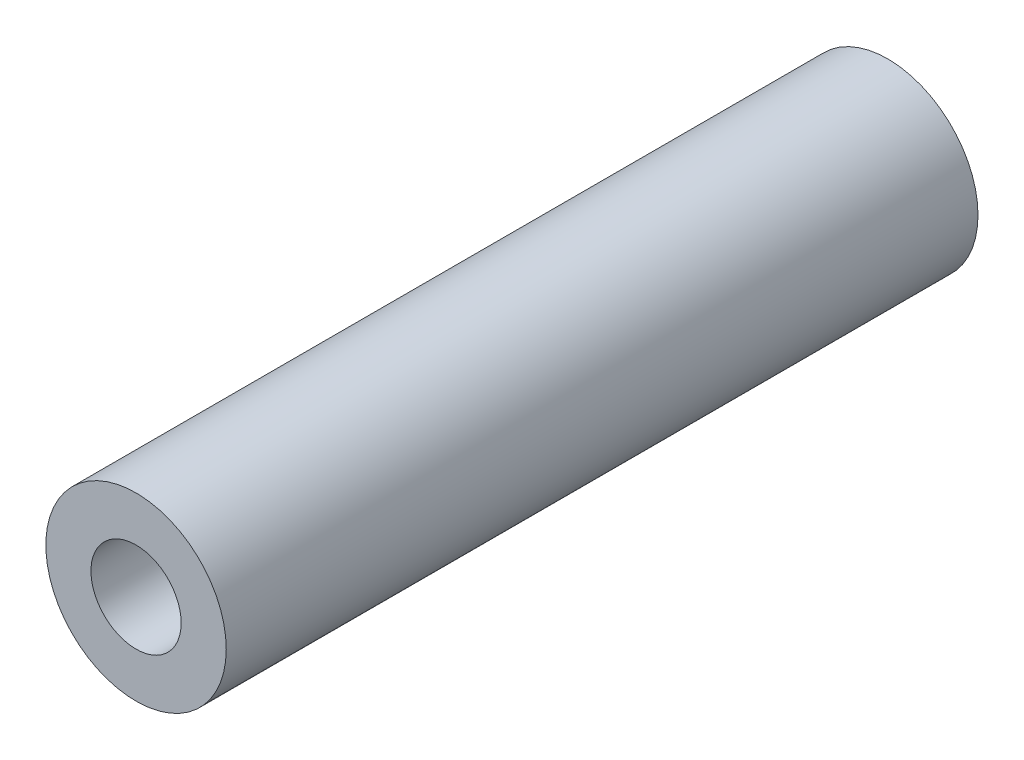
ISO-10303-21;
HEADER;
FILE_DESCRIPTION(('STEP AP214'),'2;1');
FILE_NAME('part.step','',(''),(''),'','','');
FILE_SCHEMA(('AUTOMOTIVE_DESIGN { 1 0 10303 214 1 1 1 1 }'));
ENDSEC;
DATA;
#1=APPLICATION_CONTEXT('core data for automotive mechanical design processes');
#2=APPLICATION_PROTOCOL_DEFINITION('international standard','automotive_design',2000,#1);
#3=PRODUCT_CONTEXT('',#1,'mechanical');
#4=PRODUCT('Part','Part','',(#3));
#5=PRODUCT_RELATED_PRODUCT_CATEGORY('part','',(#4));
#6=PRODUCT_DEFINITION_FORMATION('','',#4);
#7=PRODUCT_DEFINITION_CONTEXT('part definition',#1,'design');
#8=PRODUCT_DEFINITION('design','',#6,#7);
#9=PRODUCT_DEFINITION_SHAPE('','',#8);
#10=(LENGTH_UNIT() NAMED_UNIT(*) SI_UNIT(.MILLI.,.METRE.));
#11=(NAMED_UNIT(*) PLANE_ANGLE_UNIT() SI_UNIT($,.RADIAN.));
#12=(NAMED_UNIT(*) SI_UNIT($,.STERADIAN.) SOLID_ANGLE_UNIT());
#13=UNCERTAINTY_MEASURE_WITH_UNIT(LENGTH_MEASURE(1.E-05),#10,'distance_accuracy_value','');
#14=(GEOMETRIC_REPRESENTATION_CONTEXT(3) GLOBAL_UNCERTAINTY_ASSIGNED_CONTEXT((#13)) GLOBAL_UNIT_ASSIGNED_CONTEXT((#10,
#11,#12)) REPRESENTATION_CONTEXT('',''));
#15=CARTESIAN_POINT('',(0.,0.,0.));
#16=DIRECTION('',(0.,0.,1.));
#17=DIRECTION('',(1.,0.,0.));
#18=AXIS2_PLACEMENT_3D('',#15,#16,#17);
#19=CARTESIAN_POINT('',(0.,0.,25.));
#20=DIRECTION('',(0.,0.,1.));
#21=DIRECTION('',(1.,0.,0.));
#22=AXIS2_PLACEMENT_3D('',#19,#20,#21);
#23=PLANE('',#22);
#24=CARTESIAN_POINT('',(0.,0.,25.));
#25=DIRECTION('',(0.,0.,1.));
#26=DIRECTION('',(1.,0.,0.));
#27=AXIS2_PLACEMENT_3D('',#24,#25,#26);
#28=CIRCLE('',#27,3.);
#29=CARTESIAN_POINT('',(3.,0.,25.));
#30=VERTEX_POINT('',#29);
#31=EDGE_CURVE('E10',#30,#30,#28,.T.);
#32=ORIENTED_EDGE('',*,*,#31,.T.);
#33=EDGE_LOOP('',(#32));
#34=FACE_BOUND('',#33,.T.);
#35=CARTESIAN_POINT('',(0.,0.,25.));
#36=DIRECTION('',(0.,0.,1.));
#37=DIRECTION('',(1.,0.,0.));
#38=AXIS2_PLACEMENT_3D('',#35,#36,#37);
#39=CIRCLE('',#38,1.5);
#40=CARTESIAN_POINT('',(1.5,0.,25.));
#41=VERTEX_POINT('',#40);
#42=EDGE_CURVE('E50',#41,#41,#39,.T.);
#43=ORIENTED_EDGE('',*,*,#42,.F.);
#44=EDGE_LOOP('',(#43));
#45=FACE_BOUND('',#44,.T.);
#46=ADVANCED_FACE('F37',(#34,#45),#23,.T.);
#47=CARTESIAN_POINT('',(0.,0.,0.));
#48=DIRECTION('',(0.,0.,1.));
#49=DIRECTION('',(1.,0.,0.));
#50=AXIS2_PLACEMENT_3D('',#47,#48,#49);
#51=PLANE('',#50);
#52=CARTESIAN_POINT('',(0.,0.,0.));
#53=DIRECTION('',(0.,0.,1.));
#54=DIRECTION('',(1.,0.,0.));
#55=AXIS2_PLACEMENT_3D('',#52,#53,#54);
#56=CIRCLE('',#55,3.);
#57=CARTESIAN_POINT('',(3.,0.,0.));
#58=VERTEX_POINT('',#57);
#59=EDGE_CURVE('E41',#58,#58,#56,.T.);
#60=ORIENTED_EDGE('',*,*,#59,.F.);
#61=EDGE_LOOP('',(#60));
#62=FACE_BOUND('',#61,.T.);
#63=CARTESIAN_POINT('',(0.,0.,0.));
#64=DIRECTION('',(0.,0.,1.));
#65=DIRECTION('',(1.,0.,0.));
#66=AXIS2_PLACEMENT_3D('',#63,#64,#65);
#67=CIRCLE('',#66,1.5);
#68=CARTESIAN_POINT('',(1.5,0.,0.));
#69=VERTEX_POINT('',#68);
#70=EDGE_CURVE('E52',#69,#69,#67,.T.);
#71=ORIENTED_EDGE('',*,*,#70,.T.);
#72=EDGE_LOOP('',(#71));
#73=FACE_BOUND('',#72,.T.);
#74=ADVANCED_FACE('F64',(#62,#73),#51,.F.);
#75=CARTESIAN_POINT('',(0.,0.,25.));
#76=DIRECTION('',(0.,0.,-1.));
#77=DIRECTION('',(-1.,0.,0.));
#78=AXIS2_PLACEMENT_3D('',#75,#76,#77);
#79=CYLINDRICAL_SURFACE('',#78,3.);
#80=ORIENTED_EDGE('',*,*,#31,.F.);
#81=EDGE_LOOP('',(#80));
#82=FACE_BOUND('',#81,.T.);
#83=ORIENTED_EDGE('',*,*,#59,.T.);
#84=EDGE_LOOP('',(#83));
#85=FACE_BOUND('',#84,.T.);
#86=ADVANCED_FACE('F39',(#82,#85),#79,.T.);
#87=CARTESIAN_POINT('',(0.,0.,25.));
#88=DIRECTION('',(0.,0.,-1.));
#89=DIRECTION('',(-1.,0.,0.));
#90=AXIS2_PLACEMENT_3D('',#87,#88,#89);
#91=CYLINDRICAL_SURFACE('',#90,1.5);
#92=ORIENTED_EDGE('',*,*,#42,.T.);
#93=EDGE_LOOP('',(#92));
#94=FACE_BOUND('',#93,.T.);
#95=ORIENTED_EDGE('',*,*,#70,.F.);
#96=EDGE_LOOP('',(#95));
#97=FACE_BOUND('',#96,.T.);
#98=ADVANCED_FACE('F60',(#94,#97),#91,.F.);
#99=CLOSED_SHELL('',(#46,#74,#86,#98));
#100=MANIFOLD_SOLID_BREP('B2',#99);
#101=ADVANCED_BREP_SHAPE_REPRESENTATION('',(#18,#100),#14);
#102=SHAPE_DEFINITION_REPRESENTATION(#9,#101);
ENDSEC;
END-ISO-10303-21;
